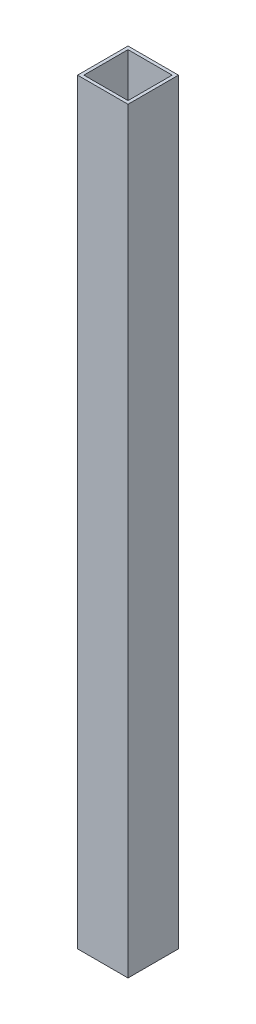
ISO-10303-21;
HEADER;
FILE_DESCRIPTION(('STEP AP214'),'2;1');
FILE_NAME('part.step','',(''),(''),'','','');
FILE_SCHEMA(('AUTOMOTIVE_DESIGN { 1 0 10303 214 1 1 1 1 }'));
ENDSEC;
DATA;
#1=APPLICATION_CONTEXT('core data for automotive mechanical design processes');
#2=APPLICATION_PROTOCOL_DEFINITION('international standard','automotive_design',2000,#1);
#3=PRODUCT_CONTEXT('',#1,'mechanical');
#4=PRODUCT('Part','Part','',(#3));
#5=PRODUCT_RELATED_PRODUCT_CATEGORY('part','',(#4));
#6=PRODUCT_DEFINITION_FORMATION('','',#4);
#7=PRODUCT_DEFINITION_CONTEXT('part definition',#1,'design');
#8=PRODUCT_DEFINITION('design','',#6,#7);
#9=PRODUCT_DEFINITION_SHAPE('','',#8);
#10=(LENGTH_UNIT() NAMED_UNIT(*) SI_UNIT(.MILLI.,.METRE.));
#11=(NAMED_UNIT(*) PLANE_ANGLE_UNIT() SI_UNIT($,.RADIAN.));
#12=(NAMED_UNIT(*) SI_UNIT($,.STERADIAN.) SOLID_ANGLE_UNIT());
#13=UNCERTAINTY_MEASURE_WITH_UNIT(LENGTH_MEASURE(1.E-05),#10,'distance_accuracy_value','');
#14=(GEOMETRIC_REPRESENTATION_CONTEXT(3) GLOBAL_UNCERTAINTY_ASSIGNED_CONTEXT((#13)) GLOBAL_UNIT_ASSIGNED_CONTEXT((#10,
#11,#12)) REPRESENTATION_CONTEXT('',''));
#15=CARTESIAN_POINT('',(0.,0.,0.));
#16=DIRECTION('',(0.,0.,1.));
#17=DIRECTION('',(1.,0.,0.));
#18=AXIS2_PLACEMENT_3D('',#15,#16,#17);
#19=CARTESIAN_POINT('',(0.,381.,0.));
#20=DIRECTION('',(0.,-1.,0.));
#21=DIRECTION('',(0.,0.,-1.));
#22=AXIS2_PLACEMENT_3D('',#19,#20,#21);
#23=PLANE('',#22);
#24=DIRECTION('',(0.,0.,1.));
#25=VECTOR('',#24,1.);
#26=CARTESIAN_POINT('',(-12.7,381.,-12.7));
#27=LINE('',#26,#25);
#28=CARTESIAN_POINT('',(-12.7,381.,-12.7));
#29=VERTEX_POINT('',#28);
#30=CARTESIAN_POINT('',(-12.7,381.,12.7));
#31=VERTEX_POINT('',#30);
#32=EDGE_CURVE('E134',#29,#31,#27,.T.);
#33=ORIENTED_EDGE('',*,*,#32,.T.);
#34=DIRECTION('',(1.,0.,0.));
#35=VECTOR('',#34,1.);
#36=CARTESIAN_POINT('',(12.7,381.,12.7));
#37=LINE('',#36,#35);
#38=CARTESIAN_POINT('',(12.7,381.,12.7));
#39=VERTEX_POINT('',#38);
#40=EDGE_CURVE('E137',#31,#39,#37,.T.);
#41=ORIENTED_EDGE('',*,*,#40,.T.);
#42=DIRECTION('',(0.,0.,-1.));
#43=VECTOR('',#42,1.);
#44=CARTESIAN_POINT('',(12.7,381.,-12.7));
#45=LINE('',#44,#43);
#46=CARTESIAN_POINT('',(12.7,381.,-12.7));
#47=VERTEX_POINT('',#46);
#48=EDGE_CURVE('E140',#39,#47,#45,.T.);
#49=ORIENTED_EDGE('',*,*,#48,.T.);
#50=DIRECTION('',(-1.,0.,0.));
#51=VECTOR('',#50,1.);
#52=CARTESIAN_POINT('',(12.7,381.,-12.7));
#53=LINE('',#52,#51);
#54=EDGE_CURVE('E142',#47,#29,#53,.T.);
#55=ORIENTED_EDGE('',*,*,#54,.T.);
#56=EDGE_LOOP('',(#33,#41,#49,#55));
#57=FACE_BOUND('',#56,.T.);
#58=DIRECTION('',(-1.,0.,0.));
#59=VECTOR('',#58,1.);
#60=CARTESIAN_POINT('',(11.1125,381.,-11.1125));
#61=LINE('',#60,#59);
#62=CARTESIAN_POINT('',(11.1125,381.,-11.1125));
#63=VERTEX_POINT('',#62);
#64=CARTESIAN_POINT('',(-11.1125,381.,-11.1125));
#65=VERTEX_POINT('',#64);
#66=EDGE_CURVE('E98',#63,#65,#61,.T.);
#67=ORIENTED_EDGE('',*,*,#66,.F.);
#68=DIRECTION('',(0.,0.,-1.));
#69=VECTOR('',#68,1.);
#70=CARTESIAN_POINT('',(11.1125,381.,-11.1125));
#71=LINE('',#70,#69);
#72=CARTESIAN_POINT('',(11.1125,381.,11.1125));
#73=VERTEX_POINT('',#72);
#74=EDGE_CURVE('E120',#73,#63,#71,.T.);
#75=ORIENTED_EDGE('',*,*,#74,.F.);
#76=DIRECTION('',(1.,0.,0.));
#77=VECTOR('',#76,1.);
#78=CARTESIAN_POINT('',(11.1125,381.,11.1125));
#79=LINE('',#78,#77);
#80=CARTESIAN_POINT('',(-11.1125,381.,11.1125));
#81=VERTEX_POINT('',#80);
#82=EDGE_CURVE('E118',#81,#73,#79,.T.);
#83=ORIENTED_EDGE('',*,*,#82,.F.);
#84=DIRECTION('',(0.,0.,1.));
#85=VECTOR('',#84,1.);
#86=CARTESIAN_POINT('',(-11.1125,381.,-11.1125));
#87=LINE('',#86,#85);
#88=EDGE_CURVE('E106',#65,#81,#87,.T.);
#89=ORIENTED_EDGE('',*,*,#88,.F.);
#90=EDGE_LOOP('',(#67,#75,#83,#89));
#91=FACE_BOUND('',#90,.T.);
#92=ADVANCED_FACE('F33',(#57,#91),#23,.F.);
#93=CARTESIAN_POINT('',(0.,0.,0.));
#94=DIRECTION('',(0.,-1.,0.));
#95=DIRECTION('',(0.,0.,-1.));
#96=AXIS2_PLACEMENT_3D('',#93,#94,#95);
#97=PLANE('',#96);
#98=DIRECTION('',(0.,0.,1.));
#99=VECTOR('',#98,1.);
#100=CARTESIAN_POINT('',(-12.7,0.,-12.7));
#101=LINE('',#100,#99);
#102=CARTESIAN_POINT('',(-12.7,0.,-12.7));
#103=VERTEX_POINT('',#102);
#104=CARTESIAN_POINT('',(-12.7,0.,12.7));
#105=VERTEX_POINT('',#104);
#106=EDGE_CURVE('E114',#103,#105,#101,.T.);
#107=ORIENTED_EDGE('',*,*,#106,.F.);
#108=DIRECTION('',(-1.,0.,0.));
#109=VECTOR('',#108,1.);
#110=CARTESIAN_POINT('',(12.7,0.,-12.7));
#111=LINE('',#110,#109);
#112=CARTESIAN_POINT('',(12.7,0.,-12.7));
#113=VERTEX_POINT('',#112);
#114=EDGE_CURVE('E138',#113,#103,#111,.T.);
#115=ORIENTED_EDGE('',*,*,#114,.F.);
#116=DIRECTION('',(0.,0.,-1.));
#117=VECTOR('',#116,1.);
#118=CARTESIAN_POINT('',(12.7,0.,-12.7));
#119=LINE('',#118,#117);
#120=CARTESIAN_POINT('',(12.7,0.,12.7));
#121=VERTEX_POINT('',#120);
#122=EDGE_CURVE('E149',#121,#113,#119,.T.);
#123=ORIENTED_EDGE('',*,*,#122,.F.);
#124=DIRECTION('',(1.,0.,0.));
#125=VECTOR('',#124,1.);
#126=CARTESIAN_POINT('',(12.7,0.,12.7));
#127=LINE('',#126,#125);
#128=EDGE_CURVE('E147',#105,#121,#127,.T.);
#129=ORIENTED_EDGE('',*,*,#128,.F.);
#130=EDGE_LOOP('',(#107,#115,#123,#129));
#131=FACE_BOUND('',#130,.T.);
#132=DIRECTION('',(0.,0.,-1.));
#133=VECTOR('',#132,1.);
#134=CARTESIAN_POINT('',(11.1125,0.,-11.1125));
#135=LINE('',#134,#133);
#136=CARTESIAN_POINT('',(11.1125,0.,11.1125));
#137=VERTEX_POINT('',#136);
#138=CARTESIAN_POINT('',(11.1125,0.,-11.1125));
#139=VERTEX_POINT('',#138);
#140=EDGE_CURVE('E107',#137,#139,#135,.T.);
#141=ORIENTED_EDGE('',*,*,#140,.T.);
#142=DIRECTION('',(-1.,0.,0.));
#143=VECTOR('',#142,1.);
#144=CARTESIAN_POINT('',(11.1125,0.,-11.1125));
#145=LINE('',#144,#143);
#146=CARTESIAN_POINT('',(-11.1125,0.,-11.1125));
#147=VERTEX_POINT('',#146);
#148=EDGE_CURVE('E56',#139,#147,#145,.T.);
#149=ORIENTED_EDGE('',*,*,#148,.T.);
#150=DIRECTION('',(0.,0.,1.));
#151=VECTOR('',#150,1.);
#152=CARTESIAN_POINT('',(-11.1125,0.,-11.1125));
#153=LINE('',#152,#151);
#154=CARTESIAN_POINT('',(-11.1125,0.,11.1125));
#155=VERTEX_POINT('',#154);
#156=EDGE_CURVE('E113',#147,#155,#153,.T.);
#157=ORIENTED_EDGE('',*,*,#156,.T.);
#158=DIRECTION('',(1.,0.,0.));
#159=VECTOR('',#158,1.);
#160=CARTESIAN_POINT('',(11.1125,0.,11.1125));
#161=LINE('',#160,#159);
#162=EDGE_CURVE('E126',#155,#137,#161,.T.);
#163=ORIENTED_EDGE('',*,*,#162,.T.);
#164=EDGE_LOOP('',(#141,#149,#157,#163));
#165=FACE_BOUND('',#164,.T.);
#166=ADVANCED_FACE('F167',(#131,#165),#97,.T.);
#167=CARTESIAN_POINT('',(-12.7,381.,-12.7));
#168=DIRECTION('',(1.,0.,0.));
#169=DIRECTION('',(0.,0.,-1.));
#170=AXIS2_PLACEMENT_3D('',#167,#168,#169);
#171=PLANE('',#170);
#172=ORIENTED_EDGE('',*,*,#106,.T.);
#173=DIRECTION('',(0.,-1.,0.));
#174=VECTOR('',#173,1.);
#175=CARTESIAN_POINT('',(-12.7,381.,12.7));
#176=LINE('',#175,#174);
#177=EDGE_CURVE('E11',#31,#105,#176,.T.);
#178=ORIENTED_EDGE('',*,*,#177,.F.);
#179=ORIENTED_EDGE('',*,*,#32,.F.);
#180=DIRECTION('',(0.,-1.,0.));
#181=VECTOR('',#180,1.);
#182=CARTESIAN_POINT('',(-12.7,381.,-12.7));
#183=LINE('',#182,#181);
#184=EDGE_CURVE('E144',#29,#103,#183,.T.);
#185=ORIENTED_EDGE('',*,*,#184,.T.);
#186=EDGE_LOOP('',(#172,#178,#179,#185));
#187=FACE_BOUND('',#186,.T.);
#188=ADVANCED_FACE('F35',(#187),#171,.F.);
#189=CARTESIAN_POINT('',(12.7,381.,12.7));
#190=DIRECTION('',(0.,0.,-1.));
#191=DIRECTION('',(-1.,0.,0.));
#192=AXIS2_PLACEMENT_3D('',#189,#190,#191);
#193=PLANE('',#192);
#194=ORIENTED_EDGE('',*,*,#128,.T.);
#195=DIRECTION('',(0.,-1.,0.));
#196=VECTOR('',#195,1.);
#197=CARTESIAN_POINT('',(12.7,381.,12.7));
#198=LINE('',#197,#196);
#199=EDGE_CURVE('E41',#39,#121,#198,.T.);
#200=ORIENTED_EDGE('',*,*,#199,.F.);
#201=ORIENTED_EDGE('',*,*,#40,.F.);
#202=ORIENTED_EDGE('',*,*,#177,.T.);
#203=EDGE_LOOP('',(#194,#200,#201,#202));
#204=FACE_BOUND('',#203,.T.);
#205=ADVANCED_FACE('F177',(#204),#193,.F.);
#206=CARTESIAN_POINT('',(12.7,381.,-12.7));
#207=DIRECTION('',(-1.,0.,0.));
#208=DIRECTION('',(0.,0.,1.));
#209=AXIS2_PLACEMENT_3D('',#206,#207,#208);
#210=PLANE('',#209);
#211=ORIENTED_EDGE('',*,*,#122,.T.);
#212=DIRECTION('',(0.,-1.,0.));
#213=VECTOR('',#212,1.);
#214=CARTESIAN_POINT('',(12.7,381.,-12.7));
#215=LINE('',#214,#213);
#216=EDGE_CURVE('E154',#47,#113,#215,.T.);
#217=ORIENTED_EDGE('',*,*,#216,.F.);
#218=ORIENTED_EDGE('',*,*,#48,.F.);
#219=ORIENTED_EDGE('',*,*,#199,.T.);
#220=EDGE_LOOP('',(#211,#217,#218,#219));
#221=FACE_BOUND('',#220,.T.);
#222=ADVANCED_FACE('F161',(#221),#210,.F.);
#223=CARTESIAN_POINT('',(12.7,381.,-12.7));
#224=DIRECTION('',(0.,0.,1.));
#225=DIRECTION('',(1.,0.,0.));
#226=AXIS2_PLACEMENT_3D('',#223,#224,#225);
#227=PLANE('',#226);
#228=ORIENTED_EDGE('',*,*,#114,.T.);
#229=ORIENTED_EDGE('',*,*,#184,.F.);
#230=ORIENTED_EDGE('',*,*,#54,.F.);
#231=ORIENTED_EDGE('',*,*,#216,.T.);
#232=EDGE_LOOP('',(#228,#229,#230,#231));
#233=FACE_BOUND('',#232,.T.);
#234=ADVANCED_FACE('F171',(#233),#227,.F.);
#235=CARTESIAN_POINT('',(11.1125,381.,-11.1125));
#236=DIRECTION('',(0.,0.,1.));
#237=DIRECTION('',(1.,0.,0.));
#238=AXIS2_PLACEMENT_3D('',#235,#236,#237);
#239=PLANE('',#238);
#240=ORIENTED_EDGE('',*,*,#148,.F.);
#241=DIRECTION('',(0.,-1.,0.));
#242=VECTOR('',#241,1.);
#243=CARTESIAN_POINT('',(11.1125,381.,-11.1125));
#244=LINE('',#243,#242);
#245=EDGE_CURVE('E102',#63,#139,#244,.T.);
#246=ORIENTED_EDGE('',*,*,#245,.F.);
#247=ORIENTED_EDGE('',*,*,#66,.T.);
#248=DIRECTION('',(0.,-1.,0.));
#249=VECTOR('',#248,1.);
#250=CARTESIAN_POINT('',(-11.1125,381.,-11.1125));
#251=LINE('',#250,#249);
#252=EDGE_CURVE('E101',#65,#147,#251,.T.);
#253=ORIENTED_EDGE('',*,*,#252,.T.);
#254=EDGE_LOOP('',(#240,#246,#247,#253));
#255=FACE_BOUND('',#254,.T.);
#256=ADVANCED_FACE('F100',(#255),#239,.T.);
#257=CARTESIAN_POINT('',(-11.1125,381.,-11.1125));
#258=DIRECTION('',(1.,0.,0.));
#259=DIRECTION('',(0.,0.,-1.));
#260=AXIS2_PLACEMENT_3D('',#257,#258,#259);
#261=PLANE('',#260);
#262=ORIENTED_EDGE('',*,*,#156,.F.);
#263=ORIENTED_EDGE('',*,*,#252,.F.);
#264=ORIENTED_EDGE('',*,*,#88,.T.);
#265=DIRECTION('',(0.,-1.,0.));
#266=VECTOR('',#265,1.);
#267=CARTESIAN_POINT('',(-11.1125,381.,11.1125));
#268=LINE('',#267,#266);
#269=EDGE_CURVE('E115',#81,#155,#268,.T.);
#270=ORIENTED_EDGE('',*,*,#269,.T.);
#271=EDGE_LOOP('',(#262,#263,#264,#270));
#272=FACE_BOUND('',#271,.T.);
#273=ADVANCED_FACE('F110',(#272),#261,.T.);
#274=CARTESIAN_POINT('',(11.1125,381.,11.1125));
#275=DIRECTION('',(0.,0.,-1.));
#276=DIRECTION('',(-1.,0.,0.));
#277=AXIS2_PLACEMENT_3D('',#274,#275,#276);
#278=PLANE('',#277);
#279=ORIENTED_EDGE('',*,*,#162,.F.);
#280=ORIENTED_EDGE('',*,*,#269,.F.);
#281=ORIENTED_EDGE('',*,*,#82,.T.);
#282=DIRECTION('',(0.,-1.,0.));
#283=VECTOR('',#282,1.);
#284=CARTESIAN_POINT('',(11.1125,381.,11.1125));
#285=LINE('',#284,#283);
#286=EDGE_CURVE('E48',#73,#137,#285,.T.);
#287=ORIENTED_EDGE('',*,*,#286,.T.);
#288=EDGE_LOOP('',(#279,#280,#281,#287));
#289=FACE_BOUND('',#288,.T.);
#290=ADVANCED_FACE('F200',(#289),#278,.T.);
#291=CARTESIAN_POINT('',(11.1125,381.,-11.1125));
#292=DIRECTION('',(-1.,0.,0.));
#293=DIRECTION('',(0.,0.,1.));
#294=AXIS2_PLACEMENT_3D('',#291,#292,#293);
#295=PLANE('',#294);
#296=ORIENTED_EDGE('',*,*,#140,.F.);
#297=ORIENTED_EDGE('',*,*,#286,.F.);
#298=ORIENTED_EDGE('',*,*,#74,.T.);
#299=ORIENTED_EDGE('',*,*,#245,.T.);
#300=EDGE_LOOP('',(#296,#297,#298,#299));
#301=FACE_BOUND('',#300,.T.);
#302=ADVANCED_FACE('F204',(#301),#295,.T.);
#303=CLOSED_SHELL('',(#92,#166,#188,#205,#222,#234,#256,#273,#290,#302));
#304=MANIFOLD_SOLID_BREP('B2',#303);
#305=ADVANCED_BREP_SHAPE_REPRESENTATION('',(#18,#304),#14);
#306=SHAPE_DEFINITION_REPRESENTATION(#9,#305);
ENDSEC;
END-ISO-10303-21;
